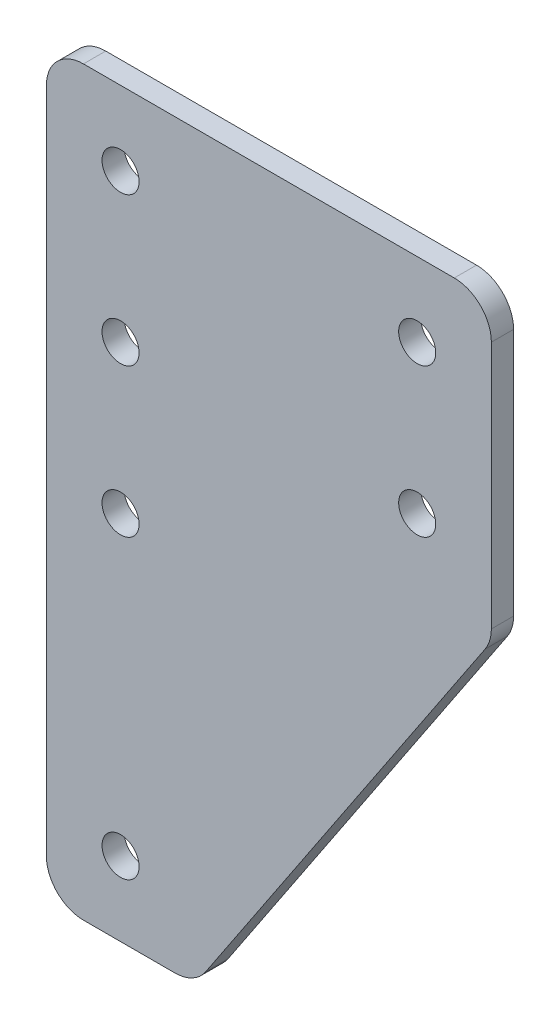
ISO-10303-21;
HEADER;
FILE_DESCRIPTION(('STEP AP214'),'2;1');
FILE_NAME('part.step','',(''),(''),'','','');
FILE_SCHEMA(('AUTOMOTIVE_DESIGN { 1 0 10303 214 1 1 1 1 }'));
ENDSEC;
DATA;
#1=APPLICATION_CONTEXT('core data for automotive mechanical design processes');
#2=APPLICATION_PROTOCOL_DEFINITION('international standard','automotive_design',2000,#1);
#3=PRODUCT_CONTEXT('',#1,'mechanical');
#4=PRODUCT('Part','Part','',(#3));
#5=PRODUCT_RELATED_PRODUCT_CATEGORY('part','',(#4));
#6=PRODUCT_DEFINITION_FORMATION('','',#4);
#7=PRODUCT_DEFINITION_CONTEXT('part definition',#1,'design');
#8=PRODUCT_DEFINITION('design','',#6,#7);
#9=PRODUCT_DEFINITION_SHAPE('','',#8);
#10=(LENGTH_UNIT() NAMED_UNIT(*) SI_UNIT(.MILLI.,.METRE.));
#11=(NAMED_UNIT(*) PLANE_ANGLE_UNIT() SI_UNIT($,.RADIAN.));
#12=(NAMED_UNIT(*) SI_UNIT($,.STERADIAN.) SOLID_ANGLE_UNIT());
#13=UNCERTAINTY_MEASURE_WITH_UNIT(LENGTH_MEASURE(1.E-05),#10,'distance_accuracy_value','');
#14=(GEOMETRIC_REPRESENTATION_CONTEXT(3) GLOBAL_UNCERTAINTY_ASSIGNED_CONTEXT((#13)) GLOBAL_UNIT_ASSIGNED_CONTEXT((#10,
#11,#12)) REPRESENTATION_CONTEXT('',''));
#15=CARTESIAN_POINT('',(0.,0.,0.));
#16=DIRECTION('',(0.,0.,1.));
#17=DIRECTION('',(1.,0.,0.));
#18=AXIS2_PLACEMENT_3D('',#15,#16,#17);
#19=CARTESIAN_POINT('',(0.,100.,3.));
#20=DIRECTION('',(1.,0.,0.));
#21=DIRECTION('',(0.,1.,0.));
#22=AXIS2_PLACEMENT_3D('',#19,#20,#21);
#23=PLANE('',#22);
#24=DIRECTION('',(0.,-1.,0.));
#25=VECTOR('',#24,1.);
#26=CARTESIAN_POINT('',(0.,100.,0.));
#27=LINE('',#26,#25);
#28=CARTESIAN_POINT('',(0.,95.,0.));
#29=VERTEX_POINT('',#28);
#30=CARTESIAN_POINT('',(0.,5.,0.));
#31=VERTEX_POINT('',#30);
#32=EDGE_CURVE('E149',#29,#31,#27,.T.);
#33=ORIENTED_EDGE('',*,*,#32,.T.);
#34=DIRECTION('',(0.,0.,-1.));
#35=VECTOR('',#34,1.);
#36=CARTESIAN_POINT('',(0.,5.,3.));
#37=LINE('',#36,#35);
#38=CARTESIAN_POINT('',(0.,5.,3.));
#39=VERTEX_POINT('',#38);
#40=EDGE_CURVE('E126',#31,#39,#37,.F.);
#41=ORIENTED_EDGE('',*,*,#40,.T.);
#42=DIRECTION('',(0.,-1.,0.));
#43=VECTOR('',#42,1.);
#44=CARTESIAN_POINT('',(0.,100.,3.));
#45=LINE('',#44,#43);
#46=CARTESIAN_POINT('',(0.,95.,3.));
#47=VERTEX_POINT('',#46);
#48=EDGE_CURVE('E162',#47,#39,#45,.T.);
#49=ORIENTED_EDGE('',*,*,#48,.F.);
#50=DIRECTION('',(0.,0.,-1.));
#51=VECTOR('',#50,1.);
#52=CARTESIAN_POINT('',(0.,95.,3.));
#53=LINE('',#52,#51);
#54=EDGE_CURVE('E131',#47,#29,#53,.T.);
#55=ORIENTED_EDGE('',*,*,#54,.T.);
#56=EDGE_LOOP('',(#33,#41,#49,#55));
#57=FACE_BOUND('',#56,.T.);
#58=ADVANCED_FACE('F43',(#57),#23,.F.);
#59=CARTESIAN_POINT('',(0.,0.,3.));
#60=DIRECTION('',(0.,1.,0.));
#61=DIRECTION('',(0.,0.,1.));
#62=AXIS2_PLACEMENT_3D('',#59,#60,#61);
#63=PLANE('',#62);
#64=DIRECTION('',(1.,0.,0.));
#65=VECTOR('',#64,1.);
#66=CARTESIAN_POINT('',(0.,0.,3.));
#67=LINE('',#66,#65);
#68=CARTESIAN_POINT('',(5.,0.,3.));
#69=VERTEX_POINT('',#68);
#70=CARTESIAN_POINT('',(17.32408120756,0.,3.));
#71=VERTEX_POINT('',#70);
#72=EDGE_CURVE('E141',#69,#71,#67,.T.);
#73=ORIENTED_EDGE('',*,*,#72,.F.);
#74=DIRECTION('',(0.,0.,-1.));
#75=VECTOR('',#74,1.);
#76=CARTESIAN_POINT('',(5.,0.,3.));
#77=LINE('',#76,#75);
#78=CARTESIAN_POINT('',(5.,0.,0.));
#79=VERTEX_POINT('',#78);
#80=EDGE_CURVE('E125',#69,#79,#77,.T.);
#81=ORIENTED_EDGE('',*,*,#80,.T.);
#82=DIRECTION('',(1.,0.,0.));
#83=VECTOR('',#82,1.);
#84=CARTESIAN_POINT('',(0.,0.,0.));
#85=LINE('',#84,#83);
#86=CARTESIAN_POINT('',(17.32408120756,0.,0.));
#87=VERTEX_POINT('',#86);
#88=EDGE_CURVE('E138',#79,#87,#85,.T.);
#89=ORIENTED_EDGE('',*,*,#88,.T.);
#90=DIRECTION('',(0.,0.,-1.));
#91=VECTOR('',#90,1.);
#92=CARTESIAN_POINT('',(17.32408120756,0.,3.));
#93=LINE('',#92,#91);
#94=EDGE_CURVE('E143',#87,#71,#93,.F.);
#95=ORIENTED_EDGE('',*,*,#94,.T.);
#96=EDGE_LOOP('',(#73,#81,#89,#95));
#97=FACE_BOUND('',#96,.T.);
#98=ADVANCED_FACE('F137',(#97),#63,.F.);
#99=CARTESIAN_POINT('',(20.,0.,3.));
#100=DIRECTION('',(-0.832050294337844,0.554700196225229,0.));
#101=DIRECTION('',(-0.554700196225229,-0.832050294337844,0.));
#102=AXIS2_PLACEMENT_3D('',#99,#100,#101);
#103=PLANE('',#102);
#104=DIRECTION('',(0.554700196225229,0.832050294337844,0.));
#105=VECTOR('',#104,1.);
#106=CARTESIAN_POINT('',(20.,0.,3.));
#107=LINE('',#106,#105);
#108=CARTESIAN_POINT('',(21.4843326792492,2.22649901887385,3.));
#109=VERTEX_POINT('',#108);
#110=CARTESIAN_POINT('',(59.1602514716892,58.7403772075339,3.));
#111=VERTEX_POINT('',#110);
#112=EDGE_CURVE('E219',#109,#111,#107,.T.);
#113=ORIENTED_EDGE('',*,*,#112,.F.);
#114=DIRECTION('',(0.,0.,-1.));
#115=VECTOR('',#114,1.);
#116=CARTESIAN_POINT('',(21.4843326792492,2.22649901887385,3.));
#117=LINE('',#116,#115);
#118=CARTESIAN_POINT('',(21.4843326792492,2.22649901887385,0.));
#119=VERTEX_POINT('',#118);
#120=EDGE_CURVE('E197',#109,#119,#117,.T.);
#121=ORIENTED_EDGE('',*,*,#120,.T.);
#122=DIRECTION('',(0.554700196225229,0.832050294337844,0.));
#123=VECTOR('',#122,1.);
#124=CARTESIAN_POINT('',(20.,0.,0.));
#125=LINE('',#124,#123);
#126=CARTESIAN_POINT('',(59.1602514716892,58.7403772075339,0.));
#127=VERTEX_POINT('',#126);
#128=EDGE_CURVE('E148',#119,#127,#125,.T.);
#129=ORIENTED_EDGE('',*,*,#128,.T.);
#130=DIRECTION('',(0.,0.,-1.));
#131=VECTOR('',#130,1.);
#132=CARTESIAN_POINT('',(59.1602514716892,58.7403772075339,3.));
#133=LINE('',#132,#131);
#134=EDGE_CURVE('E195',#127,#111,#133,.F.);
#135=ORIENTED_EDGE('',*,*,#134,.T.);
#136=EDGE_LOOP('',(#113,#121,#129,#135));
#137=FACE_BOUND('',#136,.T.);
#138=ADVANCED_FACE('F297',(#137),#103,.F.);
#139=CARTESIAN_POINT('',(60.,60.,3.));
#140=DIRECTION('',(-1.,0.,0.));
#141=DIRECTION('',(0.,0.,1.));
#142=AXIS2_PLACEMENT_3D('',#139,#140,#141);
#143=PLANE('',#142);
#144=DIRECTION('',(0.,1.,0.));
#145=VECTOR('',#144,1.);
#146=CARTESIAN_POINT('',(60.,60.,3.));
#147=LINE('',#146,#145);
#148=CARTESIAN_POINT('',(60.,61.51387818866,3.));
#149=VERTEX_POINT('',#148);
#150=CARTESIAN_POINT('',(60.,95.,3.));
#151=VERTEX_POINT('',#150);
#152=EDGE_CURVE('E210',#149,#151,#147,.T.);
#153=ORIENTED_EDGE('',*,*,#152,.F.);
#154=DIRECTION('',(0.,0.,-1.));
#155=VECTOR('',#154,1.);
#156=CARTESIAN_POINT('',(60.,61.51387818866,3.));
#157=LINE('',#156,#155);
#158=CARTESIAN_POINT('',(60.,61.51387818866,0.));
#159=VERTEX_POINT('',#158);
#160=EDGE_CURVE('E202',#149,#159,#157,.T.);
#161=ORIENTED_EDGE('',*,*,#160,.T.);
#162=DIRECTION('',(0.,1.,0.));
#163=VECTOR('',#162,1.);
#164=CARTESIAN_POINT('',(60.,60.,0.));
#165=LINE('',#164,#163);
#166=CARTESIAN_POINT('',(60.,95.,0.));
#167=VERTEX_POINT('',#166);
#168=EDGE_CURVE('E152',#159,#167,#165,.T.);
#169=ORIENTED_EDGE('',*,*,#168,.T.);
#170=DIRECTION('',(0.,0.,-1.));
#171=VECTOR('',#170,1.);
#172=CARTESIAN_POINT('',(60.,95.,3.));
#173=LINE('',#172,#171);
#174=EDGE_CURVE('E200',#167,#151,#173,.F.);
#175=ORIENTED_EDGE('',*,*,#174,.T.);
#176=EDGE_LOOP('',(#153,#161,#169,#175));
#177=FACE_BOUND('',#176,.T.);
#178=ADVANCED_FACE('F208',(#177),#143,.F.);
#179=CARTESIAN_POINT('',(60.,100.,3.));
#180=DIRECTION('',(0.,-1.,0.));
#181=DIRECTION('',(1.,0.,0.));
#182=AXIS2_PLACEMENT_3D('',#179,#180,#181);
#183=PLANE('',#182);
#184=DIRECTION('',(-1.,0.,0.));
#185=VECTOR('',#184,1.);
#186=CARTESIAN_POINT('',(60.,100.,3.));
#187=LINE('',#186,#185);
#188=CARTESIAN_POINT('',(55.,100.,3.));
#189=VERTEX_POINT('',#188);
#190=CARTESIAN_POINT('',(5.,100.,3.));
#191=VERTEX_POINT('',#190);
#192=EDGE_CURVE('E167',#189,#191,#187,.T.);
#193=ORIENTED_EDGE('',*,*,#192,.F.);
#194=DIRECTION('',(0.,0.,-1.));
#195=VECTOR('',#194,1.);
#196=CARTESIAN_POINT('',(55.,100.,3.));
#197=LINE('',#196,#195);
#198=CARTESIAN_POINT('',(55.,100.,0.));
#199=VERTEX_POINT('',#198);
#200=EDGE_CURVE('E11',#189,#199,#197,.T.);
#201=ORIENTED_EDGE('',*,*,#200,.T.);
#202=DIRECTION('',(-1.,0.,0.));
#203=VECTOR('',#202,1.);
#204=CARTESIAN_POINT('',(60.,100.,0.));
#205=LINE('',#204,#203);
#206=CARTESIAN_POINT('',(5.,100.,0.));
#207=VERTEX_POINT('',#206);
#208=EDGE_CURVE('E160',#199,#207,#205,.T.);
#209=ORIENTED_EDGE('',*,*,#208,.T.);
#210=DIRECTION('',(0.,0.,-1.));
#211=VECTOR('',#210,1.);
#212=CARTESIAN_POINT('',(5.,100.,3.));
#213=LINE('',#212,#211);
#214=EDGE_CURVE('E51',#207,#191,#213,.F.);
#215=ORIENTED_EDGE('',*,*,#214,.T.);
#216=EDGE_LOOP('',(#193,#201,#209,#215));
#217=FACE_BOUND('',#216,.T.);
#218=ADVANCED_FACE('F217',(#217),#183,.F.);
#219=CARTESIAN_POINT('',(0.,0.,3.));
#220=DIRECTION('',(0.,0.,1.));
#221=DIRECTION('',(1.,0.,0.));
#222=AXIS2_PLACEMENT_3D('',#219,#220,#221);
#223=PLANE('',#222);
#224=CARTESIAN_POINT('',(10.,50.,3.));
#225=DIRECTION('',(0.,0.,1.));
#226=DIRECTION('',(1.,0.,0.));
#227=AXIS2_PLACEMENT_3D('',#224,#225,#226);
#228=CIRCLE('',#227,2.5);
#229=CARTESIAN_POINT('',(12.5,50.,3.));
#230=VERTEX_POINT('',#229);
#231=EDGE_CURVE('E245',#230,#230,#228,.T.);
#232=ORIENTED_EDGE('',*,*,#231,.F.);
#233=EDGE_LOOP('',(#232));
#234=FACE_BOUND('',#233,.T.);
#235=CARTESIAN_POINT('',(10.,9.99999999999999,3.));
#236=DIRECTION('',(0.,0.,1.));
#237=DIRECTION('',(1.,0.,0.));
#238=AXIS2_PLACEMENT_3D('',#235,#236,#237);
#239=CIRCLE('',#238,2.5);
#240=CARTESIAN_POINT('',(12.5,9.99999999999999,3.));
#241=VERTEX_POINT('',#240);
#242=EDGE_CURVE('E239',#241,#241,#239,.T.);
#243=ORIENTED_EDGE('',*,*,#242,.F.);
#244=EDGE_LOOP('',(#243));
#245=FACE_BOUND('',#244,.T.);
#246=CARTESIAN_POINT('',(9.99999999999999,90.,3.));
#247=DIRECTION('',(0.,0.,1.));
#248=DIRECTION('',(1.,0.,0.));
#249=AXIS2_PLACEMENT_3D('',#246,#247,#248);
#250=CIRCLE('',#249,2.5);
#251=CARTESIAN_POINT('',(12.5,90.,3.));
#252=VERTEX_POINT('',#251);
#253=EDGE_CURVE('E230',#252,#252,#250,.T.);
#254=ORIENTED_EDGE('',*,*,#253,.F.);
#255=EDGE_LOOP('',(#254));
#256=FACE_BOUND('',#255,.T.);
#257=CARTESIAN_POINT('',(50.,90.,3.));
#258=DIRECTION('',(0.,0.,1.));
#259=DIRECTION('',(1.,0.,0.));
#260=AXIS2_PLACEMENT_3D('',#257,#258,#259);
#261=CIRCLE('',#260,2.5);
#262=CARTESIAN_POINT('',(52.5,90.,3.));
#263=VERTEX_POINT('',#262);
#264=EDGE_CURVE('E227',#263,#263,#261,.T.);
#265=ORIENTED_EDGE('',*,*,#264,.F.);
#266=EDGE_LOOP('',(#265));
#267=FACE_BOUND('',#266,.T.);
#268=ORIENTED_EDGE('',*,*,#48,.T.);
#269=CARTESIAN_POINT('',(5.,5.,3.));
#270=DIRECTION('',(0.,0.,1.));
#271=DIRECTION('',(1.,0.,0.));
#272=AXIS2_PLACEMENT_3D('',#269,#270,#271);
#273=CIRCLE('',#272,5.);
#274=EDGE_CURVE('E193',#39,#69,#273,.T.);
#275=ORIENTED_EDGE('',*,*,#274,.T.);
#276=ORIENTED_EDGE('',*,*,#72,.T.);
#277=CARTESIAN_POINT('',(17.32408120756,5.,3.));
#278=DIRECTION('',(0.,0.,1.));
#279=DIRECTION('',(1.,0.,0.));
#280=AXIS2_PLACEMENT_3D('',#277,#278,#279);
#281=CIRCLE('',#280,5.);
#282=EDGE_CURVE('E191',#71,#109,#281,.T.);
#283=ORIENTED_EDGE('',*,*,#282,.T.);
#284=ORIENTED_EDGE('',*,*,#112,.T.);
#285=CARTESIAN_POINT('',(55.,61.51387818866,3.));
#286=DIRECTION('',(0.,0.,1.));
#287=DIRECTION('',(1.,0.,0.));
#288=AXIS2_PLACEMENT_3D('',#285,#286,#287);
#289=CIRCLE('',#288,5.);
#290=EDGE_CURVE('E189',#111,#149,#289,.T.);
#291=ORIENTED_EDGE('',*,*,#290,.T.);
#292=ORIENTED_EDGE('',*,*,#152,.T.);
#293=CARTESIAN_POINT('',(55.,95.,3.));
#294=DIRECTION('',(0.,0.,1.));
#295=DIRECTION('',(1.,0.,0.));
#296=AXIS2_PLACEMENT_3D('',#293,#294,#295);
#297=CIRCLE('',#296,5.);
#298=EDGE_CURVE('E64',#151,#189,#297,.T.);
#299=ORIENTED_EDGE('',*,*,#298,.T.);
#300=ORIENTED_EDGE('',*,*,#192,.T.);
#301=CARTESIAN_POINT('',(5.,95.,3.));
#302=DIRECTION('',(0.,0.,1.));
#303=DIRECTION('',(1.,0.,0.));
#304=AXIS2_PLACEMENT_3D('',#301,#302,#303);
#305=CIRCLE('',#304,5.);
#306=EDGE_CURVE('E186',#191,#47,#305,.T.);
#307=ORIENTED_EDGE('',*,*,#306,.T.);
#308=EDGE_LOOP('',(#268,#275,#276,#283,#284,#291,#292,#299,#300,#307));
#309=FACE_BOUND('',#308,.T.);
#310=CARTESIAN_POINT('',(50.,70.,3.));
#311=DIRECTION('',(0.,0.,1.));
#312=DIRECTION('',(1.,0.,0.));
#313=AXIS2_PLACEMENT_3D('',#310,#311,#312);
#314=CIRCLE('',#313,2.5);
#315=CARTESIAN_POINT('',(52.5,70.,3.));
#316=VERTEX_POINT('',#315);
#317=EDGE_CURVE('E166',#316,#316,#314,.T.);
#318=ORIENTED_EDGE('',*,*,#317,.F.);
#319=EDGE_LOOP('',(#318));
#320=FACE_BOUND('',#319,.T.);
#321=CARTESIAN_POINT('',(9.99999999999999,70.,3.));
#322=DIRECTION('',(0.,0.,1.));
#323=DIRECTION('',(1.,0.,0.));
#324=AXIS2_PLACEMENT_3D('',#321,#322,#323);
#325=CIRCLE('',#324,2.5);
#326=CARTESIAN_POINT('',(12.5,70.,3.));
#327=VERTEX_POINT('',#326);
#328=EDGE_CURVE('E173',#327,#327,#325,.T.);
#329=ORIENTED_EDGE('',*,*,#328,.F.);
#330=EDGE_LOOP('',(#329));
#331=FACE_BOUND('',#330,.T.);
#332=ADVANCED_FACE('F260',(#234,#245,#256,#267,#309,#320,#331),#223,.T.);
#333=CARTESIAN_POINT('',(0.,0.,0.));
#334=DIRECTION('',(0.,0.,1.));
#335=DIRECTION('',(1.,0.,0.));
#336=AXIS2_PLACEMENT_3D('',#333,#334,#335);
#337=PLANE('',#336);
#338=CARTESIAN_POINT('',(10.,50.,0.));
#339=DIRECTION('',(0.,0.,1.));
#340=DIRECTION('',(1.,0.,0.));
#341=AXIS2_PLACEMENT_3D('',#338,#339,#340);
#342=CIRCLE('',#341,2.5);
#343=CARTESIAN_POINT('',(12.5,50.,0.));
#344=VERTEX_POINT('',#343);
#345=EDGE_CURVE('E242',#344,#344,#342,.T.);
#346=ORIENTED_EDGE('',*,*,#345,.T.);
#347=EDGE_LOOP('',(#346));
#348=FACE_BOUND('',#347,.T.);
#349=CARTESIAN_POINT('',(10.,9.99999999999999,0.));
#350=DIRECTION('',(0.,0.,1.));
#351=DIRECTION('',(1.,0.,0.));
#352=AXIS2_PLACEMENT_3D('',#349,#350,#351);
#353=CIRCLE('',#352,2.5);
#354=CARTESIAN_POINT('',(12.5,9.99999999999999,0.));
#355=VERTEX_POINT('',#354);
#356=EDGE_CURVE('E238',#355,#355,#353,.T.);
#357=ORIENTED_EDGE('',*,*,#356,.T.);
#358=EDGE_LOOP('',(#357));
#359=FACE_BOUND('',#358,.T.);
#360=CARTESIAN_POINT('',(9.99999999999999,90.,0.));
#361=DIRECTION('',(0.,0.,1.));
#362=DIRECTION('',(1.,0.,0.));
#363=AXIS2_PLACEMENT_3D('',#360,#361,#362);
#364=CIRCLE('',#363,2.5);
#365=CARTESIAN_POINT('',(12.5,90.,0.));
#366=VERTEX_POINT('',#365);
#367=EDGE_CURVE('E235',#366,#366,#364,.T.);
#368=ORIENTED_EDGE('',*,*,#367,.T.);
#369=EDGE_LOOP('',(#368));
#370=FACE_BOUND('',#369,.T.);
#371=CARTESIAN_POINT('',(50.,90.,0.));
#372=DIRECTION('',(0.,0.,1.));
#373=DIRECTION('',(1.,0.,0.));
#374=AXIS2_PLACEMENT_3D('',#371,#372,#373);
#375=CIRCLE('',#374,2.5);
#376=CARTESIAN_POINT('',(52.5,90.,0.));
#377=VERTEX_POINT('',#376);
#378=EDGE_CURVE('E154',#377,#377,#375,.T.);
#379=ORIENTED_EDGE('',*,*,#378,.T.);
#380=EDGE_LOOP('',(#379));
#381=FACE_BOUND('',#380,.T.);
#382=ORIENTED_EDGE('',*,*,#88,.F.);
#383=CARTESIAN_POINT('',(5.,5.,0.));
#384=DIRECTION('',(0.,0.,1.));
#385=DIRECTION('',(1.,0.,0.));
#386=AXIS2_PLACEMENT_3D('',#383,#384,#385);
#387=CIRCLE('',#386,5.);
#388=EDGE_CURVE('E121',#79,#31,#387,.F.);
#389=ORIENTED_EDGE('',*,*,#388,.T.);
#390=ORIENTED_EDGE('',*,*,#32,.F.);
#391=CARTESIAN_POINT('',(5.,95.,0.));
#392=DIRECTION('',(0.,0.,1.));
#393=DIRECTION('',(1.,0.,0.));
#394=AXIS2_PLACEMENT_3D('',#391,#392,#393);
#395=CIRCLE('',#394,5.);
#396=EDGE_CURVE('E142',#29,#207,#395,.F.);
#397=ORIENTED_EDGE('',*,*,#396,.T.);
#398=ORIENTED_EDGE('',*,*,#208,.F.);
#399=CARTESIAN_POINT('',(55.,95.,0.));
#400=DIRECTION('',(0.,0.,1.));
#401=DIRECTION('',(1.,0.,0.));
#402=AXIS2_PLACEMENT_3D('',#399,#400,#401);
#403=CIRCLE('',#402,5.);
#404=EDGE_CURVE('E178',#199,#167,#403,.F.);
#405=ORIENTED_EDGE('',*,*,#404,.T.);
#406=ORIENTED_EDGE('',*,*,#168,.F.);
#407=CARTESIAN_POINT('',(55.,61.51387818866,0.));
#408=DIRECTION('',(0.,0.,1.));
#409=DIRECTION('',(1.,0.,0.));
#410=AXIS2_PLACEMENT_3D('',#407,#408,#409);
#411=CIRCLE('',#410,5.);
#412=EDGE_CURVE('E180',#159,#127,#411,.F.);
#413=ORIENTED_EDGE('',*,*,#412,.T.);
#414=ORIENTED_EDGE('',*,*,#128,.F.);
#415=CARTESIAN_POINT('',(17.32408120756,5.,0.));
#416=DIRECTION('',(0.,0.,1.));
#417=DIRECTION('',(1.,0.,0.));
#418=AXIS2_PLACEMENT_3D('',#415,#416,#417);
#419=CIRCLE('',#418,5.);
#420=EDGE_CURVE('E132',#119,#87,#419,.F.);
#421=ORIENTED_EDGE('',*,*,#420,.T.);
#422=EDGE_LOOP('',(#382,#389,#390,#397,#398,#405,#406,#413,#414,#421));
#423=FACE_BOUND('',#422,.T.);
#424=CARTESIAN_POINT('',(50.,70.,0.));
#425=DIRECTION('',(0.,0.,1.));
#426=DIRECTION('',(1.,0.,0.));
#427=AXIS2_PLACEMENT_3D('',#424,#425,#426);
#428=CIRCLE('',#427,2.5);
#429=CARTESIAN_POINT('',(52.5,70.,0.));
#430=VERTEX_POINT('',#429);
#431=EDGE_CURVE('E163',#430,#430,#428,.T.);
#432=ORIENTED_EDGE('',*,*,#431,.T.);
#433=EDGE_LOOP('',(#432));
#434=FACE_BOUND('',#433,.T.);
#435=CARTESIAN_POINT('',(9.99999999999999,70.,0.));
#436=DIRECTION('',(0.,0.,1.));
#437=DIRECTION('',(1.,0.,0.));
#438=AXIS2_PLACEMENT_3D('',#435,#436,#437);
#439=CIRCLE('',#438,2.5);
#440=CARTESIAN_POINT('',(12.5,70.,0.));
#441=VERTEX_POINT('',#440);
#442=EDGE_CURVE('E170',#441,#441,#439,.T.);
#443=ORIENTED_EDGE('',*,*,#442,.T.);
#444=EDGE_LOOP('',(#443));
#445=FACE_BOUND('',#444,.T.);
#446=ADVANCED_FACE('F145',(#348,#359,#370,#381,#423,#434,#445),#337,.F.);
#447=CARTESIAN_POINT('',(50.,90.,0.));
#448=DIRECTION('',(0.,0.,1.));
#449=DIRECTION('',(1.,0.,0.));
#450=AXIS2_PLACEMENT_3D('',#447,#448,#449);
#451=CYLINDRICAL_SURFACE('',#450,2.5);
#452=ORIENTED_EDGE('',*,*,#378,.F.);
#453=EDGE_LOOP('',(#452));
#454=FACE_BOUND('',#453,.T.);
#455=ORIENTED_EDGE('',*,*,#264,.T.);
#456=EDGE_LOOP('',(#455));
#457=FACE_BOUND('',#456,.T.);
#458=ADVANCED_FACE('F308',(#454,#457),#451,.F.);
#459=CARTESIAN_POINT('',(9.99999999999999,90.,0.));
#460=DIRECTION('',(0.,0.,1.));
#461=DIRECTION('',(1.,0.,0.));
#462=AXIS2_PLACEMENT_3D('',#459,#460,#461);
#463=CYLINDRICAL_SURFACE('',#462,2.5);
#464=ORIENTED_EDGE('',*,*,#367,.F.);
#465=EDGE_LOOP('',(#464));
#466=FACE_BOUND('',#465,.T.);
#467=ORIENTED_EDGE('',*,*,#253,.T.);
#468=EDGE_LOOP('',(#467));
#469=FACE_BOUND('',#468,.T.);
#470=ADVANCED_FACE('F286',(#466,#469),#463,.F.);
#471=CARTESIAN_POINT('',(50.,70.,0.));
#472=DIRECTION('',(0.,0.,1.));
#473=DIRECTION('',(1.,0.,0.));
#474=AXIS2_PLACEMENT_3D('',#471,#472,#473);
#475=CYLINDRICAL_SURFACE('',#474,2.5);
#476=ORIENTED_EDGE('',*,*,#431,.F.);
#477=EDGE_LOOP('',(#476));
#478=FACE_BOUND('',#477,.T.);
#479=ORIENTED_EDGE('',*,*,#317,.T.);
#480=EDGE_LOOP('',(#479));
#481=FACE_BOUND('',#480,.T.);
#482=ADVANCED_FACE('F277',(#478,#481),#475,.F.);
#483=CARTESIAN_POINT('',(9.99999999999999,70.,0.));
#484=DIRECTION('',(0.,0.,1.));
#485=DIRECTION('',(1.,0.,0.));
#486=AXIS2_PLACEMENT_3D('',#483,#484,#485);
#487=CYLINDRICAL_SURFACE('',#486,2.5);
#488=ORIENTED_EDGE('',*,*,#442,.F.);
#489=EDGE_LOOP('',(#488));
#490=FACE_BOUND('',#489,.T.);
#491=ORIENTED_EDGE('',*,*,#328,.T.);
#492=EDGE_LOOP('',(#491));
#493=FACE_BOUND('',#492,.T.);
#494=ADVANCED_FACE('F275',(#490,#493),#487,.F.);
#495=CARTESIAN_POINT('',(10.,9.99999999999999,0.));
#496=DIRECTION('',(0.,0.,1.));
#497=DIRECTION('',(1.,0.,0.));
#498=AXIS2_PLACEMENT_3D('',#495,#496,#497);
#499=CYLINDRICAL_SURFACE('',#498,2.5);
#500=ORIENTED_EDGE('',*,*,#356,.F.);
#501=EDGE_LOOP('',(#500));
#502=FACE_BOUND('',#501,.T.);
#503=ORIENTED_EDGE('',*,*,#242,.T.);
#504=EDGE_LOOP('',(#503));
#505=FACE_BOUND('',#504,.T.);
#506=ADVANCED_FACE('F256',(#502,#505),#499,.F.);
#507=CARTESIAN_POINT('',(10.,50.,0.));
#508=DIRECTION('',(0.,0.,1.));
#509=DIRECTION('',(1.,0.,0.));
#510=AXIS2_PLACEMENT_3D('',#507,#508,#509);
#511=CYLINDRICAL_SURFACE('',#510,2.5);
#512=ORIENTED_EDGE('',*,*,#345,.F.);
#513=EDGE_LOOP('',(#512));
#514=FACE_BOUND('',#513,.T.);
#515=ORIENTED_EDGE('',*,*,#231,.T.);
#516=EDGE_LOOP('',(#515));
#517=FACE_BOUND('',#516,.T.);
#518=ADVANCED_FACE('F253',(#514,#517),#511,.F.);
#519=CARTESIAN_POINT('',(5.,5.,3.));
#520=DIRECTION('',(0.,0.,-1.));
#521=DIRECTION('',(-1.,0.,0.));
#522=AXIS2_PLACEMENT_3D('',#519,#520,#521);
#523=CYLINDRICAL_SURFACE('',#522,5.);
#524=ORIENTED_EDGE('',*,*,#274,.F.);
#525=ORIENTED_EDGE('',*,*,#40,.F.);
#526=ORIENTED_EDGE('',*,*,#388,.F.);
#527=ORIENTED_EDGE('',*,*,#80,.F.);
#528=EDGE_LOOP('',(#524,#525,#526,#527));
#529=FACE_BOUND('',#528,.T.);
#530=ADVANCED_FACE('F124',(#529),#523,.T.);
#531=CARTESIAN_POINT('',(17.32408120756,5.,3.));
#532=DIRECTION('',(0.,0.,-1.));
#533=DIRECTION('',(-1.,0.,0.));
#534=AXIS2_PLACEMENT_3D('',#531,#532,#533);
#535=CYLINDRICAL_SURFACE('',#534,5.);
#536=ORIENTED_EDGE('',*,*,#282,.F.);
#537=ORIENTED_EDGE('',*,*,#94,.F.);
#538=ORIENTED_EDGE('',*,*,#420,.F.);
#539=ORIENTED_EDGE('',*,*,#120,.F.);
#540=EDGE_LOOP('',(#536,#537,#538,#539));
#541=FACE_BOUND('',#540,.T.);
#542=ADVANCED_FACE('F365',(#541),#535,.T.);
#543=CARTESIAN_POINT('',(55.,61.51387818866,3.));
#544=DIRECTION('',(0.,0.,-1.));
#545=DIRECTION('',(-1.,0.,0.));
#546=AXIS2_PLACEMENT_3D('',#543,#544,#545);
#547=CYLINDRICAL_SURFACE('',#546,5.);
#548=ORIENTED_EDGE('',*,*,#290,.F.);
#549=ORIENTED_EDGE('',*,*,#134,.F.);
#550=ORIENTED_EDGE('',*,*,#412,.F.);
#551=ORIENTED_EDGE('',*,*,#160,.F.);
#552=EDGE_LOOP('',(#548,#549,#550,#551));
#553=FACE_BOUND('',#552,.T.);
#554=ADVANCED_FACE('F373',(#553),#547,.T.);
#555=CARTESIAN_POINT('',(55.,95.,3.));
#556=DIRECTION('',(0.,0.,-1.));
#557=DIRECTION('',(-1.,0.,0.));
#558=AXIS2_PLACEMENT_3D('',#555,#556,#557);
#559=CYLINDRICAL_SURFACE('',#558,5.);
#560=ORIENTED_EDGE('',*,*,#298,.F.);
#561=ORIENTED_EDGE('',*,*,#174,.F.);
#562=ORIENTED_EDGE('',*,*,#404,.F.);
#563=ORIENTED_EDGE('',*,*,#200,.F.);
#564=EDGE_LOOP('',(#560,#561,#562,#563));
#565=FACE_BOUND('',#564,.T.);
#566=ADVANCED_FACE('F216',(#565),#559,.T.);
#567=CARTESIAN_POINT('',(5.,95.,3.));
#568=DIRECTION('',(0.,0.,-1.));
#569=DIRECTION('',(-1.,0.,0.));
#570=AXIS2_PLACEMENT_3D('',#567,#568,#569);
#571=CYLINDRICAL_SURFACE('',#570,5.);
#572=ORIENTED_EDGE('',*,*,#306,.F.);
#573=ORIENTED_EDGE('',*,*,#214,.F.);
#574=ORIENTED_EDGE('',*,*,#396,.F.);
#575=ORIENTED_EDGE('',*,*,#54,.F.);
#576=EDGE_LOOP('',(#572,#573,#574,#575));
#577=FACE_BOUND('',#576,.T.);
#578=ADVANCED_FACE('F45',(#577),#571,.T.);
#579=CLOSED_SHELL('',(#58,#98,#138,#178,#218,#332,#446,#458,#470,#482,#494,#506,#518,#530,#542,
#554,#566,#578));
#580=MANIFOLD_SOLID_BREP('B2',#579);
#581=ADVANCED_BREP_SHAPE_REPRESENTATION('',(#18,#580),#14);
#582=SHAPE_DEFINITION_REPRESENTATION(#9,#581);
ENDSEC;
END-ISO-10303-21;
